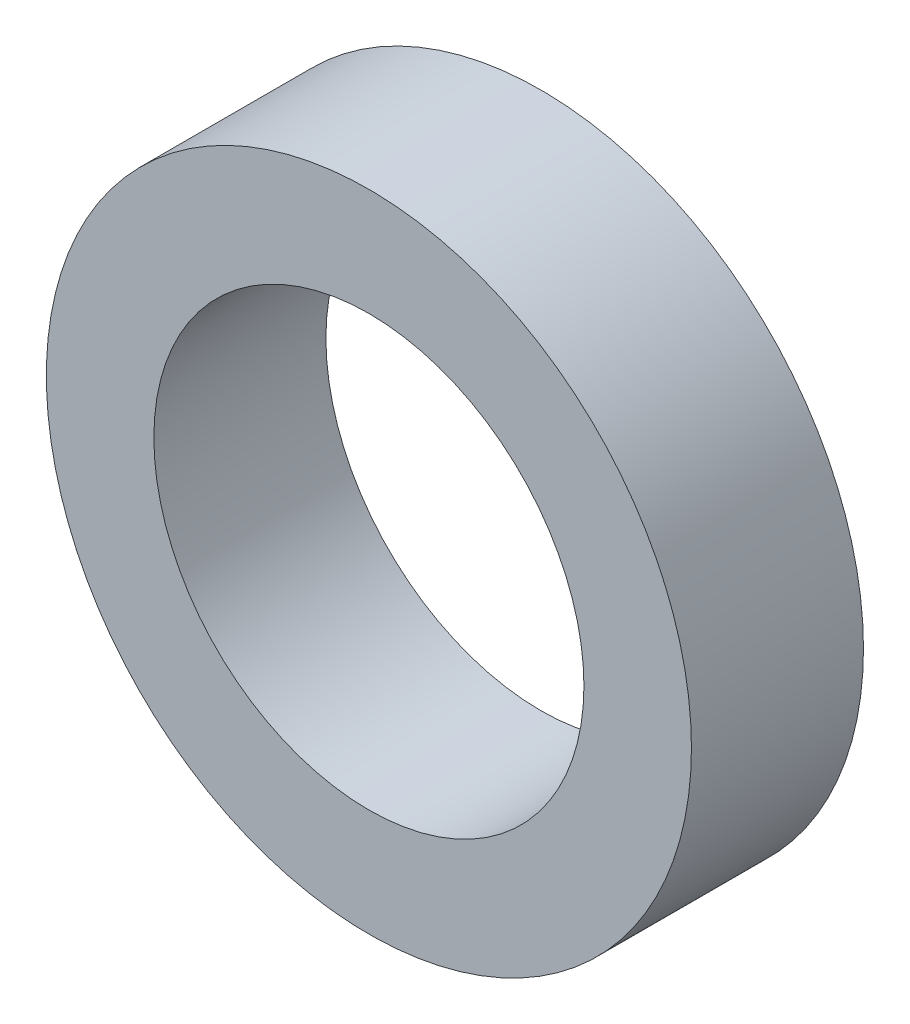
ISO-10303-21;
HEADER;
FILE_DESCRIPTION(('STEP AP214'),'2;1');
FILE_NAME('part.step','',(''),(''),'','','');
FILE_SCHEMA(('AUTOMOTIVE_DESIGN { 1 0 10303 214 1 1 1 1 }'));
ENDSEC;
DATA;
#1=APPLICATION_CONTEXT('core data for automotive mechanical design processes');
#2=APPLICATION_PROTOCOL_DEFINITION('international standard','automotive_design',2000,#1);
#3=PRODUCT_CONTEXT('',#1,'mechanical');
#4=PRODUCT('Part','Part','',(#3));
#5=PRODUCT_RELATED_PRODUCT_CATEGORY('part','',(#4));
#6=PRODUCT_DEFINITION_FORMATION('','',#4);
#7=PRODUCT_DEFINITION_CONTEXT('part definition',#1,'design');
#8=PRODUCT_DEFINITION('design','',#6,#7);
#9=PRODUCT_DEFINITION_SHAPE('','',#8);
#10=(LENGTH_UNIT() NAMED_UNIT(*) SI_UNIT(.MILLI.,.METRE.));
#11=(NAMED_UNIT(*) PLANE_ANGLE_UNIT() SI_UNIT($,.RADIAN.));
#12=(NAMED_UNIT(*) SI_UNIT($,.STERADIAN.) SOLID_ANGLE_UNIT());
#13=UNCERTAINTY_MEASURE_WITH_UNIT(LENGTH_MEASURE(1.E-05),#10,'distance_accuracy_value','');
#14=(GEOMETRIC_REPRESENTATION_CONTEXT(3) GLOBAL_UNCERTAINTY_ASSIGNED_CONTEXT((#13)) GLOBAL_UNIT_ASSIGNED_CONTEXT((#10,
#11,#12)) REPRESENTATION_CONTEXT('',''));
#15=CARTESIAN_POINT('',(0.,0.,0.));
#16=DIRECTION('',(0.,0.,1.));
#17=DIRECTION('',(1.,0.,0.));
#18=AXIS2_PLACEMENT_3D('',#15,#16,#17);
#19=CARTESIAN_POINT('',(0.,0.,4.));
#20=DIRECTION('',(0.,0.,1.));
#21=DIRECTION('',(1.,0.,0.));
#22=AXIS2_PLACEMENT_3D('',#19,#20,#21);
#23=PLANE('',#22);
#24=CARTESIAN_POINT('',(0.,0.,4.));
#25=DIRECTION('',(0.,0.,1.));
#26=DIRECTION('',(1.,0.,0.));
#27=AXIS2_PLACEMENT_3D('',#24,#25,#26);
#28=CIRCLE('',#27,7.5);
#29=CARTESIAN_POINT('',(7.5,0.,4.));
#30=VERTEX_POINT('',#29);
#31=EDGE_CURVE('E10',#30,#30,#28,.T.);
#32=ORIENTED_EDGE('',*,*,#31,.T.);
#33=EDGE_LOOP('',(#32));
#34=FACE_BOUND('',#33,.T.);
#35=CARTESIAN_POINT('',(0.,0.,4.));
#36=DIRECTION('',(0.,0.,1.));
#37=DIRECTION('',(1.,0.,0.));
#38=AXIS2_PLACEMENT_3D('',#35,#36,#37);
#39=CIRCLE('',#38,5.);
#40=CARTESIAN_POINT('',(5.,0.,4.));
#41=VERTEX_POINT('',#40);
#42=EDGE_CURVE('E48',#41,#41,#39,.T.);
#43=ORIENTED_EDGE('',*,*,#42,.F.);
#44=EDGE_LOOP('',(#43));
#45=FACE_BOUND('',#44,.T.);
#46=ADVANCED_FACE('F37',(#34,#45),#23,.T.);
#47=CARTESIAN_POINT('',(0.,0.,0.));
#48=DIRECTION('',(0.,0.,1.));
#49=DIRECTION('',(1.,0.,0.));
#50=AXIS2_PLACEMENT_3D('',#47,#48,#49);
#51=PLANE('',#50);
#52=CARTESIAN_POINT('',(0.,0.,0.));
#53=DIRECTION('',(0.,0.,1.));
#54=DIRECTION('',(1.,0.,0.));
#55=AXIS2_PLACEMENT_3D('',#52,#53,#54);
#56=CIRCLE('',#55,7.5);
#57=CARTESIAN_POINT('',(7.5,0.,0.));
#58=VERTEX_POINT('',#57);
#59=EDGE_CURVE('E41',#58,#58,#56,.T.);
#60=ORIENTED_EDGE('',*,*,#59,.F.);
#61=EDGE_LOOP('',(#60));
#62=FACE_BOUND('',#61,.T.);
#63=CARTESIAN_POINT('',(0.,0.,0.));
#64=DIRECTION('',(0.,0.,1.));
#65=DIRECTION('',(1.,0.,0.));
#66=AXIS2_PLACEMENT_3D('',#63,#64,#65);
#67=CIRCLE('',#66,5.);
#68=CARTESIAN_POINT('',(5.,0.,0.));
#69=VERTEX_POINT('',#68);
#70=EDGE_CURVE('E50',#69,#69,#67,.T.);
#71=ORIENTED_EDGE('',*,*,#70,.T.);
#72=EDGE_LOOP('',(#71));
#73=FACE_BOUND('',#72,.T.);
#74=ADVANCED_FACE('F60',(#62,#73),#51,.F.);
#75=CARTESIAN_POINT('',(0.,0.,4.));
#76=DIRECTION('',(0.,0.,-1.));
#77=DIRECTION('',(-1.,0.,0.));
#78=AXIS2_PLACEMENT_3D('',#75,#76,#77);
#79=CYLINDRICAL_SURFACE('',#78,7.5);
#80=ORIENTED_EDGE('',*,*,#31,.F.);
#81=EDGE_LOOP('',(#80));
#82=FACE_BOUND('',#81,.T.);
#83=ORIENTED_EDGE('',*,*,#59,.T.);
#84=EDGE_LOOP('',(#83));
#85=FACE_BOUND('',#84,.T.);
#86=ADVANCED_FACE('F39',(#82,#85),#79,.T.);
#87=CARTESIAN_POINT('',(0.,0.,4.));
#88=DIRECTION('',(0.,0.,-1.));
#89=DIRECTION('',(-1.,0.,0.));
#90=AXIS2_PLACEMENT_3D('',#87,#88,#89);
#91=CYLINDRICAL_SURFACE('',#90,5.);
#92=ORIENTED_EDGE('',*,*,#42,.T.);
#93=EDGE_LOOP('',(#92));
#94=FACE_BOUND('',#93,.T.);
#95=ORIENTED_EDGE('',*,*,#70,.F.);
#96=EDGE_LOOP('',(#95));
#97=FACE_BOUND('',#96,.T.);
#98=ADVANCED_FACE('F56',(#94,#97),#91,.F.);
#99=CLOSED_SHELL('',(#46,#74,#86,#98));
#100=MANIFOLD_SOLID_BREP('B2',#99);
#101=ADVANCED_BREP_SHAPE_REPRESENTATION('',(#18,#100),#14);
#102=SHAPE_DEFINITION_REPRESENTATION(#9,#101);
ENDSEC;
END-ISO-10303-21;
